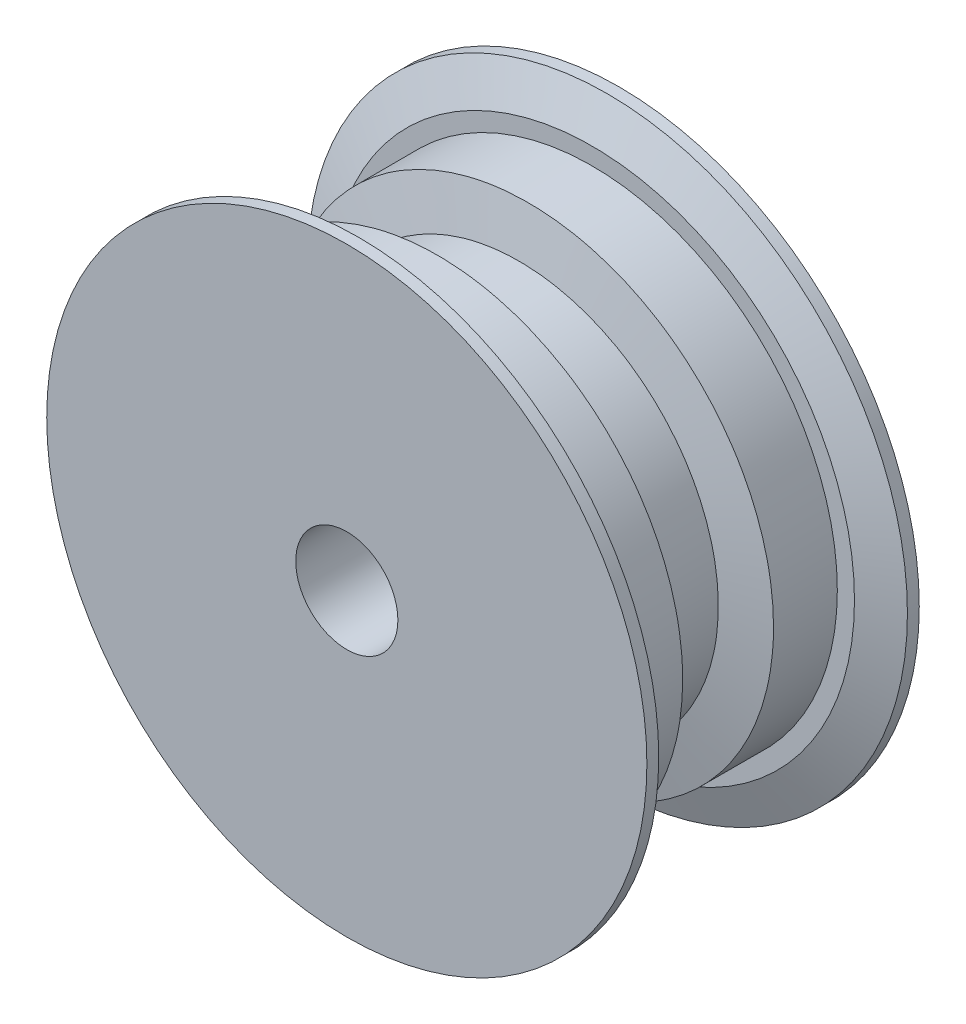
ISO-10303-21;
HEADER;
FILE_DESCRIPTION(('STEP AP214'),'2;1');
FILE_NAME('part.step','',(''),(''),'','','');
FILE_SCHEMA(('AUTOMOTIVE_DESIGN { 1 0 10303 214 1 1 1 1 }'));
ENDSEC;
DATA;
#1=APPLICATION_CONTEXT('core data for automotive mechanical design processes');
#2=APPLICATION_PROTOCOL_DEFINITION('international standard','automotive_design',2000,#1);
#3=PRODUCT_CONTEXT('',#1,'mechanical');
#4=PRODUCT('Part','Part','',(#3));
#5=PRODUCT_RELATED_PRODUCT_CATEGORY('part','',(#4));
#6=PRODUCT_DEFINITION_FORMATION('','',#4);
#7=PRODUCT_DEFINITION_CONTEXT('part definition',#1,'design');
#8=PRODUCT_DEFINITION('design','',#6,#7);
#9=PRODUCT_DEFINITION_SHAPE('','',#8);
#10=(LENGTH_UNIT() NAMED_UNIT(*) SI_UNIT(.MILLI.,.METRE.));
#11=(NAMED_UNIT(*) PLANE_ANGLE_UNIT() SI_UNIT($,.RADIAN.));
#12=(NAMED_UNIT(*) SI_UNIT($,.STERADIAN.) SOLID_ANGLE_UNIT());
#13=UNCERTAINTY_MEASURE_WITH_UNIT(LENGTH_MEASURE(1.E-05),#10,'distance_accuracy_value','');
#14=(GEOMETRIC_REPRESENTATION_CONTEXT(3) GLOBAL_UNCERTAINTY_ASSIGNED_CONTEXT((#13)) GLOBAL_UNIT_ASSIGNED_CONTEXT((#10,
#11,#12)) REPRESENTATION_CONTEXT('',''));
#15=CARTESIAN_POINT('',(0.,0.,0.));
#16=DIRECTION('',(0.,0.,1.));
#17=DIRECTION('',(1.,0.,0.));
#18=AXIS2_PLACEMENT_3D('',#15,#16,#17);
#19=CARTESIAN_POINT('',(-13.38453,0.,-2.415330196));
#20=CARTESIAN_POINT('',(-13.38453,-1.75203087891142,-2.415330196));
#21=CARTESIAN_POINT('',(-13.0361665096345,-3.50337241163998,-2.415330196));
#22=CARTESIAN_POINT('',(-11.6952201289321,-6.74070335034702,-2.415330196));
#23=CARTESIAN_POINT('',(-10.7031648413199,-8.2254190106697,-2.415330196));
#24=CARTESIAN_POINT('',(-8.22541901066968,-10.7031648413199,-2.415330196));
#25=CARTESIAN_POINT('',(-6.74070335034691,-11.6952201289321,-2.415330196));
#26=CARTESIAN_POINT('',(-3.50337241164015,-13.0361665096345,-2.415330196));
#27=CARTESIAN_POINT('',(-1.75203087891141,-13.38453,-2.415330196));
#28=CARTESIAN_POINT('',(1.75203087891143,-13.38453,-2.415330196));
#29=CARTESIAN_POINT('',(3.50337241165169,-13.0361665096297,-2.415330196));
#30=CARTESIAN_POINT('',(6.74070335033535,-11.6952201289369,-2.415330196));
#31=CARTESIAN_POINT('',(8.22541901066783,-10.7031648413217,-2.415330196));
#32=CARTESIAN_POINT('',(10.7031648413217,-8.22541901066782,-2.415330196));
#33=CARTESIAN_POINT('',(11.6952201289315,-6.74070335034837,-2.415330196));
#34=CARTESIAN_POINT('',(13.0361665096351,-3.50337241163865,-2.415330196));
#35=CARTESIAN_POINT('',(13.38453,-1.75203087890908,-2.415330196));
#36=CARTESIAN_POINT('',(13.38453,1.75203087890908,-2.415330196));
#37=CARTESIAN_POINT('',(13.0361665096345,3.50337241164011,-2.415330196));
#38=CARTESIAN_POINT('',(11.6952201289321,6.74070335034692,-2.415330196));
#39=CARTESIAN_POINT('',(10.7031648413217,8.22541901066783,-2.415330196));
#40=CARTESIAN_POINT('',(8.22541901066783,10.7031648413217,-2.415330196));
#41=CARTESIAN_POINT('',(6.74070335034783,11.6952201289317,-2.415330196));
#42=CARTESIAN_POINT('',(3.50337241163919,13.0361665096349,-2.415330196));
#43=CARTESIAN_POINT('',(1.75203087891142,13.38453,-2.415330196));
#44=CARTESIAN_POINT('',(-1.75203087891142,13.38453,-2.415330196));
#45=CARTESIAN_POINT('',(-3.50337241164,13.0361665096345,-2.415330196));
#46=CARTESIAN_POINT('',(-6.74070335034704,11.6952201289321,-2.415330196));
#47=CARTESIAN_POINT('',(-8.22541901066877,10.7031648413208,-2.415330196));
#48=CARTESIAN_POINT('',(-10.7031648413208,8.22541901066875,-2.415330196));
#49=CARTESIAN_POINT('',(-11.695220128932,6.74070335034705,-2.415330196));
#50=CARTESIAN_POINT('',(-13.0361665096345,3.50337241164002,-2.415330196));
#51=CARTESIAN_POINT('',(-13.38453,1.75203087891142,-2.415330196));
#52=CARTESIAN_POINT('',(-13.38453,0.,-2.415330196));
#53=CARTESIAN_POINT('',(-16.456410064,0.,-3.050330196));
#54=CARTESIAN_POINT('',(-16.456410064,-2.15413903873776,-3.050330196));
#55=CARTESIAN_POINT('',(-16.0280937578778,-4.30743051962459,-3.050330196));
#56=CARTESIAN_POINT('',(-14.3793871156069,-8.28776045577322,-3.050330196));
#57=CARTESIAN_POINT('',(-13.1596454721491,-10.1132328283309,-3.050330196));
#58=CARTESIAN_POINT('',(-10.1132328283328,-13.159645472151,-3.050330196));
#59=CARTESIAN_POINT('',(-8.28776045577139,-14.3793871156069,-3.050330196));
#60=CARTESIAN_POINT('',(-4.30743051962651,-16.0280937578778,-3.050330196));
#61=CARTESIAN_POINT('',(-2.15413903873775,-16.456410064,-3.050330196));
#62=CARTESIAN_POINT('',(2.15413903873777,-16.456410064,-3.050330196));
#63=CARTESIAN_POINT('',(4.30743051963957,-16.0280937578722,-3.050330196));
#64=CARTESIAN_POINT('',(8.28776045575829,-14.3793871156125,-3.050330196));
#65=CARTESIAN_POINT('',(10.1132328283309,-13.1596454721528,-3.050330196));
#66=CARTESIAN_POINT('',(13.159645472151,-10.113232828329,-3.050330196));
#67=CARTESIAN_POINT('',(14.3793871156062,-8.28776045577318,-3.050330196));
#68=CARTESIAN_POINT('',(16.0280937578785,-4.30743051962466,-3.050330196));
#69=CARTESIAN_POINT('',(16.456410064,-2.15413903873487,-3.050330196));
#70=CARTESIAN_POINT('',(16.456410064,2.15413903873487,-3.050330196));
#71=CARTESIAN_POINT('',(16.0280937578785,4.30743051962653,-3.050330196));
#72=CARTESIAN_POINT('',(14.3793871156062,8.28776045577132,-3.050330196));
#73=CARTESIAN_POINT('',(13.159645472151,10.1132328283291,-3.050330196));
#74=CARTESIAN_POINT('',(10.1132328283309,13.1596454721528,-3.050330196));
#75=CARTESIAN_POINT('',(8.28776045577323,14.3793871156069,-3.050330196));
#76=CARTESIAN_POINT('',(4.30743051962461,16.0280937578778,-3.050330196));
#77=CARTESIAN_POINT('',(2.15413903873776,16.456410064,-3.050330196));
#78=CARTESIAN_POINT('',(-2.15413903873776,16.456410064,-3.050330196));
#79=CARTESIAN_POINT('',(-4.30743051962556,16.0280937578759,-3.050330196));
#80=CARTESIAN_POINT('',(-8.28776045577231,14.3793871156088,-3.050330196));
#81=CARTESIAN_POINT('',(-10.1132328283328,13.159645472151,-3.050330196));
#82=CARTESIAN_POINT('',(-13.1596454721491,10.1132328283309,-3.050330196));
#83=CARTESIAN_POINT('',(-14.3793871156069,8.28776045577233,-3.050330196));
#84=CARTESIAN_POINT('',(-16.0280937578778,4.30743051962557,-3.050330196));
#85=CARTESIAN_POINT('',(-16.456410064,2.15413903873776,-3.050330196));
#86=CARTESIAN_POINT('',(-16.456410064,0.,-3.050330196));
#87=B_SPLINE_SURFACE_WITH_KNOTS('',1,3,((#19,#20,#21,#22,#23,#24,#25,#26,#27,#28,#29,#30,#31,
#32,#33,#34,#35,#36,#37,#38,#39,#40,#41,#42,#43,#44,#45,#46,#47,#48,#49,#50,#51,#52),(#53,#54,
#55,#56,#57,#58,#59,#60,#61,#62,#63,#64,#65,#66,#67,#68,#69,#70,#71,#72,#73,#74,#75,#76,#77,#78,
#79,#80,#81,#82,#83,#84,#85,#86)),.UNSPECIFIED.,.F.,.T.,.F.,(2,2),(4,2,2,2,2,2,2,2,2,2,2,2,2,2,
2,2,4),(0.,1.),(-3.14159265358979,-2.74889357189107,-2.35619449019234,-1.96349540849362,
-1.5707963267949,-1.17809724509617,-0.785398163397448,-0.392699081698724,0.,0.392699081698724,
0.785398163397448,1.17809724509617,1.5707963267949,1.96349540849362,2.35619449019234,
2.74889357189107,3.14159265358979),.UNSPECIFIED.);
#88=CARTESIAN_POINT('',(-16.456410064,0.,-3.050330196));
#89=CARTESIAN_POINT('',(-16.456410064,-2.15413903873776,-3.050330196));
#90=CARTESIAN_POINT('',(-16.0280937578778,-4.30743051962459,-3.050330196));
#91=CARTESIAN_POINT('',(-14.3793871156069,-8.28776045577322,-3.050330196));
#92=CARTESIAN_POINT('',(-13.1596454721491,-10.1132328283309,-3.050330196));
#93=CARTESIAN_POINT('',(-10.1132328283328,-13.159645472151,-3.050330196));
#94=CARTESIAN_POINT('',(-8.28776045577139,-14.3793871156069,-3.050330196));
#95=CARTESIAN_POINT('',(-4.30743051962651,-16.0280937578778,-3.050330196));
#96=CARTESIAN_POINT('',(-2.15413903873775,-16.456410064,-3.050330196));
#97=CARTESIAN_POINT('',(2.15413903873777,-16.456410064,-3.050330196));
#98=CARTESIAN_POINT('',(4.30743051963957,-16.0280937578722,-3.050330196));
#99=CARTESIAN_POINT('',(8.28776045575829,-14.3793871156125,-3.050330196));
#100=CARTESIAN_POINT('',(10.1132328283309,-13.1596454721528,-3.050330196));
#101=CARTESIAN_POINT('',(13.159645472151,-10.113232828329,-3.050330196));
#102=CARTESIAN_POINT('',(14.3793871156062,-8.28776045577318,-3.050330196));
#103=CARTESIAN_POINT('',(16.0280937578785,-4.30743051962466,-3.050330196));
#104=CARTESIAN_POINT('',(16.456410064,-2.15413903873487,-3.050330196));
#105=CARTESIAN_POINT('',(16.456410064,2.15413903873487,-3.050330196));
#106=CARTESIAN_POINT('',(16.0280937578785,4.30743051962653,-3.050330196));
#107=CARTESIAN_POINT('',(14.3793871156062,8.28776045577132,-3.050330196));
#108=CARTESIAN_POINT('',(13.159645472151,10.1132328283291,-3.050330196));
#109=CARTESIAN_POINT('',(10.1132328283309,13.1596454721528,-3.050330196));
#110=CARTESIAN_POINT('',(8.28776045577323,14.3793871156069,-3.050330196));
#111=CARTESIAN_POINT('',(4.30743051962461,16.0280937578778,-3.050330196));
#112=CARTESIAN_POINT('',(2.15413903873776,16.456410064,-3.050330196));
#113=CARTESIAN_POINT('',(-2.15413903873776,16.456410064,-3.050330196));
#114=CARTESIAN_POINT('',(-4.30743051962556,16.0280937578759,-3.050330196));
#115=CARTESIAN_POINT('',(-8.28776045577231,14.3793871156088,-3.050330196));
#116=CARTESIAN_POINT('',(-10.1132328283328,13.159645472151,-3.050330196));
#117=CARTESIAN_POINT('',(-13.1596454721491,10.1132328283309,-3.050330196));
#118=CARTESIAN_POINT('',(-14.3793871156069,8.28776045577233,-3.050330196));
#119=CARTESIAN_POINT('',(-16.0280937578778,4.30743051962557,-3.050330196));
#120=CARTESIAN_POINT('',(-16.456410064,2.15413903873776,-3.050330196));
#121=CARTESIAN_POINT('',(-16.456410064,0.,-3.050330196));
#122=B_SPLINE_CURVE_WITH_KNOTS('',3,(#88,#89,#90,#91,#92,#93,#94,#95,#96,#97,#98,#99,#100,#101,
#102,#103,#104,#105,#106,#107,#108,#109,#110,#111,#112,#113,#114,#115,#116,#117,#118,#119,#120,
#121),.UNSPECIFIED.,.T.,.F.,(4,2,2,2,2,2,2,2,2,2,2,2,2,2,2,2,4),(-3.14159265358979,
-2.74889357189107,-2.35619449019234,-1.96349540849362,-1.5707963267949,-1.17809724509617,
-0.785398163397448,-0.392699081698724,0.,0.392699081698724,0.785398163397448,1.17809724509617,
1.5707963267949,1.96349540849362,2.35619449019234,2.74889357189107,3.14159265358979),.UNSPECIFIED.);
#123=CARTESIAN_POINT('',(-16.456410064,0.,-3.050330196));
#124=VERTEX_POINT('',#123);
#125=EDGE_CURVE('E215',#124,#124,#122,.F.);
#126=CARTESIAN_POINT('',(-13.38453,0.,-2.415330196));
#127=CARTESIAN_POINT('',(-13.38453,1.75203087891142,-2.415330196));
#128=CARTESIAN_POINT('',(-13.0361665096345,3.50337241164002,-2.415330196));
#129=CARTESIAN_POINT('',(-11.695220128932,6.74070335034705,-2.415330196));
#130=CARTESIAN_POINT('',(-10.7031648413208,8.22541901066875,-2.415330196));
#131=CARTESIAN_POINT('',(-8.22541901066877,10.7031648413208,-2.415330196));
#132=CARTESIAN_POINT('',(-6.74070335034704,11.6952201289321,-2.415330196));
#133=CARTESIAN_POINT('',(-3.50337241164,13.0361665096345,-2.415330196));
#134=CARTESIAN_POINT('',(-1.75203087891142,13.38453,-2.415330196));
#135=CARTESIAN_POINT('',(1.75203087891142,13.38453,-2.415330196));
#136=CARTESIAN_POINT('',(3.50337241163919,13.0361665096349,-2.415330196));
#137=CARTESIAN_POINT('',(6.74070335034783,11.6952201289317,-2.415330196));
#138=CARTESIAN_POINT('',(8.22541901066783,10.7031648413217,-2.415330196));
#139=CARTESIAN_POINT('',(10.7031648413217,8.22541901066783,-2.415330196));
#140=CARTESIAN_POINT('',(11.6952201289321,6.74070335034692,-2.415330196));
#141=CARTESIAN_POINT('',(13.0361665096345,3.50337241164011,-2.415330196));
#142=CARTESIAN_POINT('',(13.38453,1.75203087890908,-2.415330196));
#143=CARTESIAN_POINT('',(13.38453,-1.75203087890908,-2.415330196));
#144=CARTESIAN_POINT('',(13.0361665096351,-3.50337241163865,-2.415330196));
#145=CARTESIAN_POINT('',(11.6952201289315,-6.74070335034837,-2.415330196));
#146=CARTESIAN_POINT('',(10.7031648413217,-8.22541901066782,-2.415330196));
#147=CARTESIAN_POINT('',(8.22541901066783,-10.7031648413217,-2.415330196));
#148=CARTESIAN_POINT('',(6.74070335033535,-11.6952201289369,-2.415330196));
#149=CARTESIAN_POINT('',(3.50337241165169,-13.0361665096297,-2.415330196));
#150=CARTESIAN_POINT('',(1.75203087891143,-13.38453,-2.415330196));
#151=CARTESIAN_POINT('',(-1.75203087891141,-13.38453,-2.415330196));
#152=CARTESIAN_POINT('',(-3.50337241164015,-13.0361665096345,-2.415330196));
#153=CARTESIAN_POINT('',(-6.74070335034691,-11.6952201289321,-2.415330196));
#154=CARTESIAN_POINT('',(-8.22541901066968,-10.7031648413199,-2.415330196));
#155=CARTESIAN_POINT('',(-10.7031648413199,-8.2254190106697,-2.415330196));
#156=CARTESIAN_POINT('',(-11.6952201289321,-6.74070335034702,-2.415330196));
#157=CARTESIAN_POINT('',(-13.0361665096345,-3.50337241163998,-2.415330196));
#158=CARTESIAN_POINT('',(-13.38453,-1.75203087891142,-2.415330196));
#159=CARTESIAN_POINT('',(-13.38453,0.,-2.415330196));
#160=B_SPLINE_CURVE_WITH_KNOTS('',3,(#126,#127,#128,#129,#130,#131,#132,#133,#134,#135,#136,
#137,#138,#139,#140,#141,#142,#143,#144,#145,#146,#147,#148,#149,#150,#151,#152,#153,#154,#155,
#156,#157,#158,#159),.UNSPECIFIED.,.T.,.F.,(4,2,2,2,2,2,2,2,2,2,2,2,2,2,2,2,4),
(-3.14159265358979,-2.74889357189107,-2.35619449019234,-1.96349540849362,-1.5707963267949,
-1.17809724509617,-0.785398163397448,-0.392699081698724,0.,0.392699081698724,0.785398163397448,
1.17809724509617,1.5707963267949,1.96349540849362,2.35619449019234,2.74889357189107,
3.14159265358979),.UNSPECIFIED.);
#161=CARTESIAN_POINT('',(-13.38453,0.,-2.415330196));
#162=VERTEX_POINT('',#161);
#163=EDGE_CURVE('E60',#162,#162,#160,.F.);
#164=ORIENTED_EDGE('',*,*,#125,.F.);
#165=EDGE_LOOP('',(#164));
#166=FACE_BOUND('',#165,.T.);
#167=ORIENTED_EDGE('',*,*,#163,.F.);
#168=EDGE_LOOP('',(#167));
#169=FACE_BOUND('',#168,.T.);
#170=ADVANCED_FACE('F40',(#166,#169),#87,.T.);
#171=CARTESIAN_POINT('',(-16.456410064,0.,3.050330196));
#172=CARTESIAN_POINT('',(-16.456410064,-2.15413903873776,3.050330196));
#173=CARTESIAN_POINT('',(-16.0280937578778,-4.30743051962459,3.050330196));
#174=CARTESIAN_POINT('',(-14.3793871156069,-8.28776045577322,3.050330196));
#175=CARTESIAN_POINT('',(-13.1596454721491,-10.1132328283309,3.050330196));
#176=CARTESIAN_POINT('',(-10.1132328283328,-13.159645472151,3.050330196));
#177=CARTESIAN_POINT('',(-8.28776045577139,-14.3793871156069,3.050330196));
#178=CARTESIAN_POINT('',(-4.30743051962651,-16.0280937578778,3.050330196));
#179=CARTESIAN_POINT('',(-2.15413903873775,-16.456410064,3.050330196));
#180=CARTESIAN_POINT('',(2.15413903873777,-16.456410064,3.050330196));
#181=CARTESIAN_POINT('',(4.30743051963957,-16.0280937578722,3.050330196));
#182=CARTESIAN_POINT('',(8.28776045575829,-14.3793871156125,3.050330196));
#183=CARTESIAN_POINT('',(10.1132328283309,-13.1596454721528,3.050330196));
#184=CARTESIAN_POINT('',(13.159645472151,-10.113232828329,3.050330196));
#185=CARTESIAN_POINT('',(14.3793871156062,-8.28776045577318,3.050330196));
#186=CARTESIAN_POINT('',(16.0280937578785,-4.30743051962466,3.050330196));
#187=CARTESIAN_POINT('',(16.456410064,-2.15413903873487,3.050330196));
#188=CARTESIAN_POINT('',(16.456410064,2.15413903873487,3.050330196));
#189=CARTESIAN_POINT('',(16.0280937578785,4.30743051962653,3.050330196));
#190=CARTESIAN_POINT('',(14.3793871156062,8.28776045577132,3.050330196));
#191=CARTESIAN_POINT('',(13.159645472151,10.1132328283291,3.050330196));
#192=CARTESIAN_POINT('',(10.1132328283309,13.1596454721528,3.050330196));
#193=CARTESIAN_POINT('',(8.28776045577323,14.3793871156069,3.050330196));
#194=CARTESIAN_POINT('',(4.30743051962461,16.0280937578778,3.050330196));
#195=CARTESIAN_POINT('',(2.15413903873776,16.456410064,3.050330196));
#196=CARTESIAN_POINT('',(-2.15413903873776,16.456410064,3.050330196));
#197=CARTESIAN_POINT('',(-4.30743051962556,16.0280937578759,3.050330196));
#198=CARTESIAN_POINT('',(-8.28776045577231,14.3793871156088,3.050330196));
#199=CARTESIAN_POINT('',(-10.1132328283328,13.159645472151,3.050330196));
#200=CARTESIAN_POINT('',(-13.1596454721491,10.1132328283309,3.050330196));
#201=CARTESIAN_POINT('',(-14.3793871156069,8.28776045577233,3.050330196));
#202=CARTESIAN_POINT('',(-16.0280937578778,4.30743051962557,3.050330196));
#203=CARTESIAN_POINT('',(-16.456410064,2.15413903873776,3.050330196));
#204=CARTESIAN_POINT('',(-16.456410064,0.,3.050330196));
#205=CARTESIAN_POINT('',(-13.38453,0.,2.415330196));
#206=CARTESIAN_POINT('',(-13.38453,-1.75203087891142,2.415330196));
#207=CARTESIAN_POINT('',(-13.0361665096345,-3.50337241163998,2.415330196));
#208=CARTESIAN_POINT('',(-11.6952201289321,-6.74070335034702,2.415330196));
#209=CARTESIAN_POINT('',(-10.7031648413199,-8.2254190106697,2.415330196));
#210=CARTESIAN_POINT('',(-8.22541901066968,-10.7031648413199,2.415330196));
#211=CARTESIAN_POINT('',(-6.74070335034691,-11.6952201289321,2.415330196));
#212=CARTESIAN_POINT('',(-3.50337241164015,-13.0361665096345,2.415330196));
#213=CARTESIAN_POINT('',(-1.75203087891141,-13.38453,2.415330196));
#214=CARTESIAN_POINT('',(1.75203087891143,-13.38453,2.415330196));
#215=CARTESIAN_POINT('',(3.50337241165169,-13.0361665096297,2.415330196));
#216=CARTESIAN_POINT('',(6.74070335033535,-11.6952201289369,2.415330196));
#217=CARTESIAN_POINT('',(8.22541901066783,-10.7031648413217,2.415330196));
#218=CARTESIAN_POINT('',(10.7031648413217,-8.22541901066782,2.415330196));
#219=CARTESIAN_POINT('',(11.6952201289315,-6.74070335034837,2.415330196));
#220=CARTESIAN_POINT('',(13.0361665096351,-3.50337241163865,2.415330196));
#221=CARTESIAN_POINT('',(13.38453,-1.75203087890908,2.415330196));
#222=CARTESIAN_POINT('',(13.38453,1.75203087890908,2.415330196));
#223=CARTESIAN_POINT('',(13.0361665096345,3.50337241164011,2.415330196));
#224=CARTESIAN_POINT('',(11.6952201289321,6.74070335034692,2.415330196));
#225=CARTESIAN_POINT('',(10.7031648413217,8.22541901066783,2.415330196));
#226=CARTESIAN_POINT('',(8.22541901066783,10.7031648413217,2.415330196));
#227=CARTESIAN_POINT('',(6.74070335034783,11.6952201289317,2.415330196));
#228=CARTESIAN_POINT('',(3.50337241163919,13.0361665096349,2.415330196));
#229=CARTESIAN_POINT('',(1.75203087891142,13.38453,2.415330196));
#230=CARTESIAN_POINT('',(-1.75203087891142,13.38453,2.415330196));
#231=CARTESIAN_POINT('',(-3.50337241164,13.0361665096345,2.415330196));
#232=CARTESIAN_POINT('',(-6.74070335034704,11.6952201289321,2.415330196));
#233=CARTESIAN_POINT('',(-8.22541901066877,10.7031648413208,2.415330196));
#234=CARTESIAN_POINT('',(-10.7031648413208,8.22541901066875,2.415330196));
#235=CARTESIAN_POINT('',(-11.695220128932,6.74070335034705,2.415330196));
#236=CARTESIAN_POINT('',(-13.0361665096345,3.50337241164002,2.415330196));
#237=CARTESIAN_POINT('',(-13.38453,1.75203087891142,2.415330196));
#238=CARTESIAN_POINT('',(-13.38453,0.,2.415330196));
#239=B_SPLINE_SURFACE_WITH_KNOTS('',1,3,((#171,#172,#173,#174,#175,#176,#177,#178,#179,#180,
#181,#182,#183,#184,#185,#186,#187,#188,#189,#190,#191,#192,#193,#194,#195,#196,#197,#198,#199,
#200,#201,#202,#203,#204),(#205,#206,#207,#208,#209,#210,#211,#212,#213,#214,#215,#216,#217,
#218,#219,#220,#221,#222,#223,#224,#225,#226,#227,#228,#229,#230,#231,#232,#233,#234,#235,#236,
#237,#238)),.UNSPECIFIED.,.F.,.T.,.F.,(2,2),(4,2,2,2,2,2,2,2,2,2,2,2,2,2,2,2,4),(0.,1.),
(-3.14159265358979,-2.74889357189107,-2.35619449019234,-1.96349540849362,-1.5707963267949,
-1.17809724509617,-0.785398163397448,-0.392699081698724,0.,0.392699081698724,0.785398163397448,
1.17809724509617,1.5707963267949,1.96349540849362,2.35619449019234,2.74889357189107,
3.14159265358979),.UNSPECIFIED.);
#240=CARTESIAN_POINT('',(-16.456410064,0.,3.050330196));
#241=CARTESIAN_POINT('',(-16.456410064,2.15413903873776,3.050330196));
#242=CARTESIAN_POINT('',(-16.0280937578778,4.30743051962557,3.050330196));
#243=CARTESIAN_POINT('',(-14.3793871156069,8.28776045577233,3.050330196));
#244=CARTESIAN_POINT('',(-13.1596454721491,10.1132328283309,3.050330196));
#245=CARTESIAN_POINT('',(-10.1132328283328,13.159645472151,3.050330196));
#246=CARTESIAN_POINT('',(-8.28776045577231,14.3793871156088,3.050330196));
#247=CARTESIAN_POINT('',(-4.30743051962556,16.0280937578759,3.050330196));
#248=CARTESIAN_POINT('',(-2.15413903873776,16.456410064,3.050330196));
#249=CARTESIAN_POINT('',(2.15413903873776,16.456410064,3.050330196));
#250=CARTESIAN_POINT('',(4.30743051962461,16.0280937578778,3.050330196));
#251=CARTESIAN_POINT('',(8.28776045577323,14.3793871156069,3.050330196));
#252=CARTESIAN_POINT('',(10.1132328283309,13.1596454721528,3.050330196));
#253=CARTESIAN_POINT('',(13.159645472151,10.1132328283291,3.050330196));
#254=CARTESIAN_POINT('',(14.3793871156062,8.28776045577132,3.050330196));
#255=CARTESIAN_POINT('',(16.0280937578785,4.30743051962653,3.050330196));
#256=CARTESIAN_POINT('',(16.456410064,2.15413903873487,3.050330196));
#257=CARTESIAN_POINT('',(16.456410064,-2.15413903873487,3.050330196));
#258=CARTESIAN_POINT('',(16.0280937578785,-4.30743051962466,3.050330196));
#259=CARTESIAN_POINT('',(14.3793871156062,-8.28776045577318,3.050330196));
#260=CARTESIAN_POINT('',(13.159645472151,-10.113232828329,3.050330196));
#261=CARTESIAN_POINT('',(10.1132328283309,-13.1596454721528,3.050330196));
#262=CARTESIAN_POINT('',(8.28776045575829,-14.3793871156125,3.050330196));
#263=CARTESIAN_POINT('',(4.30743051963957,-16.0280937578722,3.050330196));
#264=CARTESIAN_POINT('',(2.15413903873777,-16.456410064,3.050330196));
#265=CARTESIAN_POINT('',(-2.15413903873775,-16.456410064,3.050330196));
#266=CARTESIAN_POINT('',(-4.30743051962651,-16.0280937578778,3.050330196));
#267=CARTESIAN_POINT('',(-8.28776045577139,-14.3793871156069,3.050330196));
#268=CARTESIAN_POINT('',(-10.1132328283328,-13.159645472151,3.050330196));
#269=CARTESIAN_POINT('',(-13.1596454721491,-10.1132328283309,3.050330196));
#270=CARTESIAN_POINT('',(-14.3793871156069,-8.28776045577322,3.050330196));
#271=CARTESIAN_POINT('',(-16.0280937578778,-4.30743051962459,3.050330196));
#272=CARTESIAN_POINT('',(-16.456410064,-2.15413903873776,3.050330196));
#273=CARTESIAN_POINT('',(-16.456410064,0.,3.050330196));
#274=B_SPLINE_CURVE_WITH_KNOTS('',3,(#240,#241,#242,#243,#244,#245,#246,#247,#248,#249,#250,
#251,#252,#253,#254,#255,#256,#257,#258,#259,#260,#261,#262,#263,#264,#265,#266,#267,#268,#269,
#270,#271,#272,#273),.UNSPECIFIED.,.T.,.F.,(4,2,2,2,2,2,2,2,2,2,2,2,2,2,2,2,4),
(-3.14159265358979,-2.74889357189107,-2.35619449019234,-1.96349540849362,-1.5707963267949,
-1.17809724509617,-0.785398163397448,-0.392699081698724,0.,0.392699081698724,0.785398163397448,
1.17809724509617,1.5707963267949,1.96349540849362,2.35619449019234,2.74889357189107,
3.14159265358979),.UNSPECIFIED.);
#275=CARTESIAN_POINT('',(-16.456410064,0.,3.050330196));
#276=VERTEX_POINT('',#275);
#277=EDGE_CURVE('E290',#276,#276,#274,.T.);
#278=CARTESIAN_POINT('',(-13.38453,0.,2.415330196));
#279=CARTESIAN_POINT('',(-13.38453,-1.75203087891142,2.415330196));
#280=CARTESIAN_POINT('',(-13.0361665096345,-3.50337241163998,2.415330196));
#281=CARTESIAN_POINT('',(-11.6952201289321,-6.74070335034702,2.415330196));
#282=CARTESIAN_POINT('',(-10.7031648413199,-8.2254190106697,2.415330196));
#283=CARTESIAN_POINT('',(-8.22541901066968,-10.7031648413199,2.415330196));
#284=CARTESIAN_POINT('',(-6.74070335034691,-11.6952201289321,2.415330196));
#285=CARTESIAN_POINT('',(-3.50337241164015,-13.0361665096345,2.415330196));
#286=CARTESIAN_POINT('',(-1.75203087891141,-13.38453,2.415330196));
#287=CARTESIAN_POINT('',(1.75203087891143,-13.38453,2.415330196));
#288=CARTESIAN_POINT('',(3.50337241165169,-13.0361665096297,2.415330196));
#289=CARTESIAN_POINT('',(6.74070335033535,-11.6952201289369,2.415330196));
#290=CARTESIAN_POINT('',(8.22541901066783,-10.7031648413217,2.415330196));
#291=CARTESIAN_POINT('',(10.7031648413217,-8.22541901066782,2.415330196));
#292=CARTESIAN_POINT('',(11.6952201289315,-6.74070335034837,2.415330196));
#293=CARTESIAN_POINT('',(13.0361665096351,-3.50337241163865,2.415330196));
#294=CARTESIAN_POINT('',(13.38453,-1.75203087890908,2.415330196));
#295=CARTESIAN_POINT('',(13.38453,1.75203087890908,2.415330196));
#296=CARTESIAN_POINT('',(13.0361665096345,3.50337241164011,2.415330196));
#297=CARTESIAN_POINT('',(11.6952201289321,6.74070335034692,2.415330196));
#298=CARTESIAN_POINT('',(10.7031648413217,8.22541901066783,2.415330196));
#299=CARTESIAN_POINT('',(8.22541901066783,10.7031648413217,2.415330196));
#300=CARTESIAN_POINT('',(6.74070335034783,11.6952201289317,2.415330196));
#301=CARTESIAN_POINT('',(3.50337241163919,13.0361665096349,2.415330196));
#302=CARTESIAN_POINT('',(1.75203087891142,13.38453,2.415330196));
#303=CARTESIAN_POINT('',(-1.75203087891142,13.38453,2.415330196));
#304=CARTESIAN_POINT('',(-3.50337241164,13.0361665096345,2.415330196));
#305=CARTESIAN_POINT('',(-6.74070335034704,11.6952201289321,2.415330196));
#306=CARTESIAN_POINT('',(-8.22541901066877,10.7031648413208,2.415330196));
#307=CARTESIAN_POINT('',(-10.7031648413208,8.22541901066875,2.415330196));
#308=CARTESIAN_POINT('',(-11.695220128932,6.74070335034705,2.415330196));
#309=CARTESIAN_POINT('',(-13.0361665096345,3.50337241164002,2.415330196));
#310=CARTESIAN_POINT('',(-13.38453,1.75203087891142,2.415330196));
#311=CARTESIAN_POINT('',(-13.38453,0.,2.415330196));
#312=B_SPLINE_CURVE_WITH_KNOTS('',3,(#278,#279,#280,#281,#282,#283,#284,#285,#286,#287,#288,
#289,#290,#291,#292,#293,#294,#295,#296,#297,#298,#299,#300,#301,#302,#303,#304,#305,#306,#307,
#308,#309,#310,#311),.UNSPECIFIED.,.T.,.F.,(4,2,2,2,2,2,2,2,2,2,2,2,2,2,2,2,4),
(-3.14159265358979,-2.74889357189107,-2.35619449019234,-1.96349540849362,-1.5707963267949,
-1.17809724509617,-0.785398163397448,-0.392699081698724,0.,0.392699081698724,0.785398163397448,
1.17809724509617,1.5707963267949,1.96349540849362,2.35619449019234,2.74889357189107,
3.14159265358979),.UNSPECIFIED.);
#313=CARTESIAN_POINT('',(-13.38453,0.,2.415330196));
#314=VERTEX_POINT('',#313);
#315=EDGE_CURVE('E252',#314,#314,#312,.F.);
#316=ORIENTED_EDGE('',*,*,#277,.T.);
#317=EDGE_LOOP('',(#316));
#318=FACE_BOUND('',#317,.T.);
#319=ORIENTED_EDGE('',*,*,#315,.F.);
#320=EDGE_LOOP('',(#319));
#321=FACE_BOUND('',#320,.T.);
#322=ADVANCED_FACE('F76',(#318,#321),#239,.T.);
#323=CARTESIAN_POINT('',(0.,0.,-66.1327053443049));
#324=DIRECTION('',(0.,0.,1.));
#325=DIRECTION('',(1.,0.,0.));
#326=AXIS2_PLACEMENT_3D('',#323,#324,#325);
#327=CYLINDRICAL_SURFACE('',#326,16.45793);
#328=ORIENTED_EDGE('',*,*,#277,.F.);
#329=EDGE_LOOP('',(#328));
#330=FACE_BOUND('',#329,.T.);
#331=CARTESIAN_POINT('',(0.,0.,7.332999939));
#332=DIRECTION('',(0.,0.,1.));
#333=DIRECTION('',(1.,0.,0.));
#334=AXIS2_PLACEMENT_3D('',#331,#332,#333);
#335=CIRCLE('',#334,16.45793);
#336=CARTESIAN_POINT('',(16.45793,0.,7.332999939));
#337=VERTEX_POINT('',#336);
#338=EDGE_CURVE('E301',#337,#337,#335,.T.);
#339=ORIENTED_EDGE('',*,*,#338,.F.);
#340=EDGE_LOOP('',(#339));
#341=FACE_BOUND('',#340,.T.);
#342=ADVANCED_FACE('F219',(#330,#341),#327,.T.);
#343=CARTESIAN_POINT('',(0.,0.,-7.332999939));
#344=DIRECTION('',(0.,0.,1.));
#345=DIRECTION('',(1.,0.,0.));
#346=AXIS2_PLACEMENT_3D('',#343,#344,#345);
#347=CIRCLE('',#346,16.45793);
#348=CARTESIAN_POINT('',(16.45793,0.,-7.332999939));
#349=VERTEX_POINT('',#348);
#350=EDGE_CURVE('E299',#349,#349,#347,.F.);
#351=ORIENTED_EDGE('',*,*,#350,.F.);
#352=EDGE_LOOP('',(#351));
#353=FACE_BOUND('',#352,.T.);
#354=ORIENTED_EDGE('',*,*,#125,.T.);
#355=EDGE_LOOP('',(#354));
#356=FACE_BOUND('',#355,.T.);
#357=ADVANCED_FACE('F229',(#353,#356),#327,.T.);
#358=CARTESIAN_POINT('',(0.,0.,9.144));
#359=DIRECTION('',(0.,0.,1.));
#360=DIRECTION('',(1.,0.,0.));
#361=AXIS2_PLACEMENT_3D('',#358,#359,#360);
#362=PLANE('',#361);
#363=CARTESIAN_POINT('',(0.,0.,9.144));
#364=DIRECTION('',(0.,0.,1.));
#365=DIRECTION('',(1.,0.,0.));
#366=AXIS2_PLACEMENT_3D('',#363,#364,#365);
#367=CIRCLE('',#366,3.429);
#368=CARTESIAN_POINT('',(3.429,0.,9.144));
#369=VERTEX_POINT('',#368);
#370=EDGE_CURVE('E311',#369,#369,#367,.T.);
#371=ORIENTED_EDGE('',*,*,#370,.F.);
#372=EDGE_LOOP('',(#371));
#373=FACE_BOUND('',#372,.T.);
#374=CARTESIAN_POINT('',(0.,0.,9.144));
#375=DIRECTION('',(0.,0.,1.));
#376=DIRECTION('',(1.,0.,0.));
#377=AXIS2_PLACEMENT_3D('',#374,#375,#376);
#378=CIRCLE('',#377,20.14855);
#379=CARTESIAN_POINT('',(20.14855,0.,9.144));
#380=VERTEX_POINT('',#379);
#381=EDGE_CURVE('E298',#380,#380,#378,.T.);
#382=ORIENTED_EDGE('',*,*,#381,.T.);
#383=EDGE_LOOP('',(#382));
#384=FACE_BOUND('',#383,.T.);
#385=ADVANCED_FACE('F336',(#373,#384),#362,.T.);
#386=CARTESIAN_POINT('',(0.,0.,9.144));
#387=DIRECTION('',(0.,0.,-1.));
#388=DIRECTION('',(-1.,0.,0.));
#389=AXIS2_PLACEMENT_3D('',#386,#387,#388);
#390=CYLINDRICAL_SURFACE('',#389,20.14855);
#391=CARTESIAN_POINT('',(0.,0.,-8.348999939));
#392=DIRECTION('',(0.,0.,1.));
#393=DIRECTION('',(1.,0.,0.));
#394=AXIS2_PLACEMENT_3D('',#391,#392,#393);
#395=CIRCLE('',#394,20.14855);
#396=CARTESIAN_POINT('',(20.14855,0.,-8.348999939));
#397=VERTEX_POINT('',#396);
#398=EDGE_CURVE('E55',#397,#397,#395,.F.);
#399=ORIENTED_EDGE('',*,*,#398,.T.);
#400=EDGE_LOOP('',(#399));
#401=FACE_BOUND('',#400,.T.);
#402=CARTESIAN_POINT('',(0.,0.,-9.144));
#403=DIRECTION('',(0.,0.,1.));
#404=DIRECTION('',(1.,0.,0.));
#405=AXIS2_PLACEMENT_3D('',#402,#403,#404);
#406=CIRCLE('',#405,20.14855);
#407=CARTESIAN_POINT('',(20.14855,0.,-9.144));
#408=VERTEX_POINT('',#407);
#409=EDGE_CURVE('E314',#408,#408,#406,.T.);
#410=ORIENTED_EDGE('',*,*,#409,.T.);
#411=EDGE_LOOP('',(#410));
#412=FACE_BOUND('',#411,.T.);
#413=ADVANCED_FACE('F320',(#401,#412),#390,.T.);
#414=CARTESIAN_POINT('',(0.,0.,-9.144));
#415=DIRECTION('',(0.,0.,1.));
#416=DIRECTION('',(1.,0.,0.));
#417=AXIS2_PLACEMENT_3D('',#414,#415,#416);
#418=PLANE('',#417);
#419=ORIENTED_EDGE('',*,*,#409,.F.);
#420=EDGE_LOOP('',(#419));
#421=FACE_BOUND('',#420,.T.);
#422=CARTESIAN_POINT('',(0.,0.,-9.144));
#423=DIRECTION('',(0.,0.,1.));
#424=DIRECTION('',(1.,0.,0.));
#425=AXIS2_PLACEMENT_3D('',#422,#423,#424);
#426=CIRCLE('',#425,3.429);
#427=CARTESIAN_POINT('',(3.429,0.,-9.144));
#428=VERTEX_POINT('',#427);
#429=EDGE_CURVE('E310',#428,#428,#426,.T.);
#430=ORIENTED_EDGE('',*,*,#429,.T.);
#431=EDGE_LOOP('',(#430));
#432=FACE_BOUND('',#431,.T.);
#433=ADVANCED_FACE('F322',(#421,#432),#418,.F.);
#434=CARTESIAN_POINT('',(0.,0.,9.144));
#435=DIRECTION('',(0.,0.,-1.));
#436=DIRECTION('',(-1.,0.,0.));
#437=AXIS2_PLACEMENT_3D('',#434,#435,#436);
#438=CYLINDRICAL_SURFACE('',#437,3.429);
#439=ORIENTED_EDGE('',*,*,#370,.T.);
#440=EDGE_LOOP('',(#439));
#441=FACE_BOUND('',#440,.T.);
#442=ORIENTED_EDGE('',*,*,#429,.F.);
#443=EDGE_LOOP('',(#442));
#444=FACE_BOUND('',#443,.T.);
#445=ADVANCED_FACE('F233',(#441,#444),#438,.F.);
#446=CARTESIAN_POINT('',(0.,0.,-7.332999939));
#447=DIRECTION('',(0.,0.,1.));
#448=DIRECTION('',(1.,0.,0.));
#449=AXIS2_PLACEMENT_3D('',#446,#447,#448);
#450=PLANE('',#449);
#451=CARTESIAN_POINT('',(0.,0.,-7.332999939));
#452=DIRECTION('',(0.,0.,1.));
#453=DIRECTION('',(1.,0.,0.));
#454=AXIS2_PLACEMENT_3D('',#451,#452,#453);
#455=CIRCLE('',#454,17.60855);
#456=CARTESIAN_POINT('',(17.60855,0.,-7.332999939));
#457=VERTEX_POINT('',#456);
#458=EDGE_CURVE('E51',#457,#457,#455,.T.);
#459=ORIENTED_EDGE('',*,*,#458,.T.);
#460=EDGE_LOOP('',(#459));
#461=FACE_BOUND('',#460,.T.);
#462=ORIENTED_EDGE('',*,*,#350,.T.);
#463=EDGE_LOOP('',(#462));
#464=FACE_BOUND('',#463,.T.);
#465=ADVANCED_FACE('F231',(#461,#464),#450,.T.);
#466=CARTESIAN_POINT('',(0.,0.,-3.050330196));
#467=DIRECTION('',(0.,0.,1.));
#468=DIRECTION('',(1.,0.,0.));
#469=AXIS2_PLACEMENT_3D('',#466,#467,#468);
#470=CYLINDRICAL_SURFACE('',#469,13.38453);
#471=ORIENTED_EDGE('',*,*,#163,.T.);
#472=EDGE_LOOP('',(#471));
#473=FACE_BOUND('',#472,.T.);
#474=ORIENTED_EDGE('',*,*,#315,.T.);
#475=EDGE_LOOP('',(#474));
#476=FACE_BOUND('',#475,.T.);
#477=ADVANCED_FACE('F265',(#473,#476),#470,.T.);
#478=CARTESIAN_POINT('',(0.,0.,7.332999939));
#479=DIRECTION('',(0.,0.,1.));
#480=DIRECTION('',(1.,0.,0.));
#481=AXIS2_PLACEMENT_3D('',#478,#479,#480);
#482=CYLINDRICAL_SURFACE('',#481,20.14855);
#483=CARTESIAN_POINT('',(0.,0.,8.348999939));
#484=DIRECTION('',(0.,0.,1.));
#485=DIRECTION('',(1.,0.,0.));
#486=AXIS2_PLACEMENT_3D('',#483,#484,#485);
#487=CIRCLE('',#486,20.14855);
#488=CARTESIAN_POINT('',(20.14855,0.,8.348999939));
#489=VERTEX_POINT('',#488);
#490=EDGE_CURVE('E47',#489,#489,#487,.T.);
#491=ORIENTED_EDGE('',*,*,#490,.T.);
#492=EDGE_LOOP('',(#491));
#493=FACE_BOUND('',#492,.T.);
#494=ORIENTED_EDGE('',*,*,#381,.F.);
#495=EDGE_LOOP('',(#494));
#496=FACE_BOUND('',#495,.T.);
#497=ADVANCED_FACE('F274',(#493,#496),#482,.T.);
#498=CARTESIAN_POINT('',(0.,0.,7.332999939));
#499=DIRECTION('',(0.,0.,1.));
#500=DIRECTION('',(1.,0.,0.));
#501=AXIS2_PLACEMENT_3D('',#498,#499,#500);
#502=PLANE('',#501);
#503=CARTESIAN_POINT('',(0.,0.,7.332999939));
#504=DIRECTION('',(0.,0.,1.));
#505=DIRECTION('',(1.,0.,0.));
#506=AXIS2_PLACEMENT_3D('',#503,#504,#505);
#507=CIRCLE('',#506,17.60855);
#508=CARTESIAN_POINT('',(17.60855,0.,7.332999939));
#509=VERTEX_POINT('',#508);
#510=EDGE_CURVE('E13',#509,#509,#507,.F.);
#511=ORIENTED_EDGE('',*,*,#510,.T.);
#512=EDGE_LOOP('',(#511));
#513=FACE_BOUND('',#512,.T.);
#514=ORIENTED_EDGE('',*,*,#338,.T.);
#515=EDGE_LOOP('',(#514));
#516=FACE_BOUND('',#515,.T.);
#517=ADVANCED_FACE('F375',(#513,#516),#502,.F.);
#518=CARTESIAN_POINT('',(0.,0.,-8.348999939));
#519=DIRECTION('',(0.,0.,-1.));
#520=DIRECTION('',(-1.,0.,0.));
#521=AXIS2_PLACEMENT_3D('',#518,#519,#520);
#522=CONICAL_SURFACE('',#521,20.14855,1.19028994968253);
#523=ORIENTED_EDGE('',*,*,#458,.F.);
#524=EDGE_LOOP('',(#523));
#525=FACE_BOUND('',#524,.T.);
#526=ORIENTED_EDGE('',*,*,#398,.F.);
#527=EDGE_LOOP('',(#526));
#528=FACE_BOUND('',#527,.T.);
#529=ADVANCED_FACE('F82',(#525,#528),#522,.T.);
#530=CARTESIAN_POINT('',(0.,0.,8.348999939));
#531=DIRECTION('',(0.,0.,1.));
#532=DIRECTION('',(1.,0.,0.));
#533=AXIS2_PLACEMENT_3D('',#530,#531,#532);
#534=CONICAL_SURFACE('',#533,20.14855,1.19028994968253);
#535=ORIENTED_EDGE('',*,*,#510,.F.);
#536=EDGE_LOOP('',(#535));
#537=FACE_BOUND('',#536,.T.);
#538=ORIENTED_EDGE('',*,*,#490,.F.);
#539=EDGE_LOOP('',(#538));
#540=FACE_BOUND('',#539,.T.);
#541=ADVANCED_FACE('F42',(#537,#540),#534,.T.);
#542=CLOSED_SHELL('',(#170,#322,#342,#357,#385,#413,#433,#445,#465,#477,#497,#517,#529,#541));
#543=MANIFOLD_SOLID_BREP('B2',#542);
#544=ADVANCED_BREP_SHAPE_REPRESENTATION('',(#18,#543),#14);
#545=SHAPE_DEFINITION_REPRESENTATION(#9,#544);
ENDSEC;
END-ISO-10303-21;
